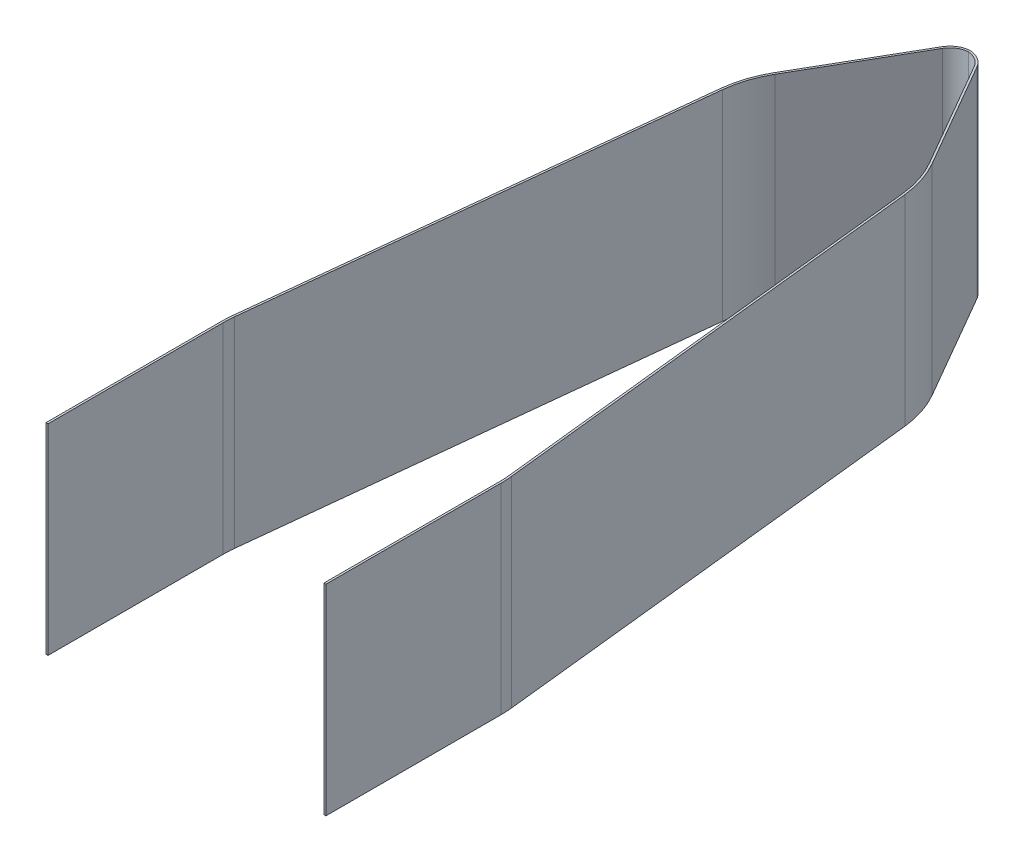
ISO-10303-21;
HEADER;
FILE_DESCRIPTION(('STEP AP214'),'2;1');
FILE_NAME('part.step','',(''),(''),'','','');
FILE_SCHEMA(('AUTOMOTIVE_DESIGN { 1 0 10303 214 1 1 1 1 }'));
ENDSEC;
DATA;
#1=APPLICATION_CONTEXT('core data for automotive mechanical design processes');
#2=APPLICATION_PROTOCOL_DEFINITION('international standard','automotive_design',2000,#1);
#3=PRODUCT_CONTEXT('',#1,'mechanical');
#4=PRODUCT('Part','Part','',(#3));
#5=PRODUCT_RELATED_PRODUCT_CATEGORY('part','',(#4));
#6=PRODUCT_DEFINITION_FORMATION('','',#4);
#7=PRODUCT_DEFINITION_CONTEXT('part definition',#1,'design');
#8=PRODUCT_DEFINITION('design','',#6,#7);
#9=PRODUCT_DEFINITION_SHAPE('','',#8);
#10=(LENGTH_UNIT() NAMED_UNIT(*) SI_UNIT(.MILLI.,.METRE.));
#11=(NAMED_UNIT(*) PLANE_ANGLE_UNIT() SI_UNIT($,.RADIAN.));
#12=(NAMED_UNIT(*) SI_UNIT($,.STERADIAN.) SOLID_ANGLE_UNIT());
#13=UNCERTAINTY_MEASURE_WITH_UNIT(LENGTH_MEASURE(1.E-05),#10,'distance_accuracy_value','');
#14=(GEOMETRIC_REPRESENTATION_CONTEXT(3) GLOBAL_UNCERTAINTY_ASSIGNED_CONTEXT((#13)) GLOBAL_UNIT_ASSIGNED_CONTEXT((#10,
#11,#12)) REPRESENTATION_CONTEXT('',''));
#15=CARTESIAN_POINT('',(0.,0.,0.));
#16=DIRECTION('',(0.,0.,1.));
#17=DIRECTION('',(1.,0.,0.));
#18=AXIS2_PLACEMENT_3D('',#15,#16,#17);
#19=CARTESIAN_POINT('',(4.7625,12.7,-24.7202799887067));
#20=DIRECTION('',(0.,-1.,0.));
#21=DIRECTION('',(0.,0.,-1.));
#22=AXIS2_PLACEMENT_3D('',#19,#20,#21);
#23=CYLINDRICAL_SURFACE('',#22,12.7);
#24=DIRECTION('',(0.,1.,0.));
#25=VECTOR('',#24,1.);
#26=CARTESIAN_POINT('',(17.4625,12.7,-24.7202799887067));
#27=LINE('',#26,#25);
#28=CARTESIAN_POINT('',(17.4625,-12.7,-24.7202799887067));
#29=VERTEX_POINT('',#28);
#30=CARTESIAN_POINT('',(17.4625,12.7,-24.7202799887067));
#31=VERTEX_POINT('',#30);
#32=EDGE_CURVE('E351',#29,#31,#27,.T.);
#33=ORIENTED_EDGE('',*,*,#32,.T.);
#34=CARTESIAN_POINT('',(4.7625,12.7,-24.7202799887067));
#35=DIRECTION('',(0.,-1.,0.));
#36=DIRECTION('',(0.,0.,-1.));
#37=AXIS2_PLACEMENT_3D('',#34,#35,#36);
#38=CIRCLE('',#37,12.7);
#39=CARTESIAN_POINT('',(17.3899488806237,12.7,-26.0758369839065));
#40=VERTEX_POINT('',#39);
#41=EDGE_CURVE('E20',#40,#31,#38,.T.);
#42=ORIENTED_EDGE('',*,*,#41,.F.);
#43=DIRECTION('',(0.,1.,0.));
#44=VECTOR('',#43,1.);
#45=CARTESIAN_POINT('',(17.3899488806237,12.7,-26.0758369839065));
#46=LINE('',#45,#44);
#47=CARTESIAN_POINT('',(17.3899488806237,-12.7,-26.0758369839065));
#48=VERTEX_POINT('',#47);
#49=EDGE_CURVE('E353',#40,#48,#46,.F.);
#50=ORIENTED_EDGE('',*,*,#49,.T.);
#51=CARTESIAN_POINT('',(4.7625,-12.7,-24.7202799887067));
#52=DIRECTION('',(0.,-1.,0.));
#53=DIRECTION('',(0.,0.,-1.));
#54=AXIS2_PLACEMENT_3D('',#51,#52,#53);
#55=CIRCLE('',#54,12.7);
#56=EDGE_CURVE('E395',#29,#48,#55,.F.);
#57=ORIENTED_EDGE('',*,*,#56,.F.);
#58=EDGE_LOOP('',(#33,#42,#50,#57));
#59=FACE_BOUND('',#58,.T.);
#60=ADVANCED_FACE('F17',(#59),#23,.F.);
#61=CARTESIAN_POINT('',(17.4625,12.7,-2.53999999999484));
#62=DIRECTION('',(0.,0.,-1.));
#63=DIRECTION('',(-1.,0.,0.));
#64=AXIS2_PLACEMENT_3D('',#61,#62,#63);
#65=PLANE('',#64);
#66=DIRECTION('',(0.,1.,0.));
#67=VECTOR('',#66,1.);
#68=CARTESIAN_POINT('',(17.7165,12.7,-2.53999999999484));
#69=LINE('',#68,#67);
#70=CARTESIAN_POINT('',(17.7165,-12.7,-2.53999999999484));
#71=VERTEX_POINT('',#70);
#72=CARTESIAN_POINT('',(17.7165,12.7,-2.53999999999484));
#73=VERTEX_POINT('',#72);
#74=EDGE_CURVE('E346',#71,#73,#69,.T.);
#75=ORIENTED_EDGE('',*,*,#74,.T.);
#76=DIRECTION('',(-1.,0.,0.));
#77=VECTOR('',#76,1.);
#78=CARTESIAN_POINT('',(17.4625,12.7,-2.53999999999484));
#79=LINE('',#78,#77);
#80=CARTESIAN_POINT('',(17.4625,12.7,-2.53999999999484));
#81=VERTEX_POINT('',#80);
#82=EDGE_CURVE('E183',#81,#73,#79,.F.);
#83=ORIENTED_EDGE('',*,*,#82,.F.);
#84=DIRECTION('',(0.,1.,0.));
#85=VECTOR('',#84,1.);
#86=CARTESIAN_POINT('',(17.4625,12.7,-2.53999999999484));
#87=LINE('',#86,#85);
#88=CARTESIAN_POINT('',(17.4625,-12.7,-2.53999999999484));
#89=VERTEX_POINT('',#88);
#90=EDGE_CURVE('E348',#81,#89,#87,.F.);
#91=ORIENTED_EDGE('',*,*,#90,.T.);
#92=DIRECTION('',(-1.,0.,0.));
#93=VECTOR('',#92,1.);
#94=CARTESIAN_POINT('',(17.4625,-12.7,-2.53999999999484));
#95=LINE('',#94,#93);
#96=EDGE_CURVE('E389',#71,#89,#95,.T.);
#97=ORIENTED_EDGE('',*,*,#96,.F.);
#98=EDGE_LOOP('',(#75,#83,#91,#97));
#99=FACE_BOUND('',#98,.T.);
#100=ADVANCED_FACE('F515',(#99),#65,.F.);
#101=CARTESIAN_POINT('',(4.7625,12.7,-24.7202799887067));
#102=DIRECTION('',(0.,-1.,0.));
#103=DIRECTION('',(0.,0.,-1.));
#104=AXIS2_PLACEMENT_3D('',#101,#102,#103);
#105=CYLINDRICAL_SURFACE('',#104,12.954);
#106=CARTESIAN_POINT('',(4.7625,12.7,-24.7202799887067));
#107=DIRECTION('',(0.,-1.,0.));
#108=DIRECTION('',(0.,0.,-1.));
#109=AXIS2_PLACEMENT_3D('',#106,#107,#108);
#110=CIRCLE('',#109,12.954);
#111=CARTESIAN_POINT('',(17.6424978582362,12.7,-26.1029481238105));
#112=VERTEX_POINT('',#111);
#113=CARTESIAN_POINT('',(17.7165,12.7,-24.7202799887067));
#114=VERTEX_POINT('',#113);
#115=EDGE_CURVE('E386',#112,#114,#110,.T.);
#116=ORIENTED_EDGE('',*,*,#115,.T.);
#117=DIRECTION('',(0.,1.,0.));
#118=VECTOR('',#117,1.);
#119=CARTESIAN_POINT('',(17.7165,12.7,-24.7202799887067));
#120=LINE('',#119,#118);
#121=CARTESIAN_POINT('',(17.7165,-12.7,-24.7202799887067));
#122=VERTEX_POINT('',#121);
#123=EDGE_CURVE('E343',#114,#122,#120,.F.);
#124=ORIENTED_EDGE('',*,*,#123,.T.);
#125=CARTESIAN_POINT('',(4.7625,-12.7,-24.7202799887067));
#126=DIRECTION('',(0.,-1.,0.));
#127=DIRECTION('',(0.,0.,-1.));
#128=AXIS2_PLACEMENT_3D('',#125,#126,#127);
#129=CIRCLE('',#128,12.954);
#130=CARTESIAN_POINT('',(17.6424978582362,-12.7,-26.1029481238105));
#131=VERTEX_POINT('',#130);
#132=EDGE_CURVE('E391',#122,#131,#129,.F.);
#133=ORIENTED_EDGE('',*,*,#132,.T.);
#134=DIRECTION('',(0.,1.,0.));
#135=VECTOR('',#134,1.);
#136=CARTESIAN_POINT('',(17.6424978582362,12.7,-26.1029481238105));
#137=LINE('',#136,#135);
#138=EDGE_CURVE('E340',#131,#112,#137,.T.);
#139=ORIENTED_EDGE('',*,*,#138,.T.);
#140=EDGE_LOOP('',(#116,#124,#133,#139));
#141=FACE_BOUND('',#140,.T.);
#142=ADVANCED_FACE('F510',(#141),#105,.T.);
#143=CARTESIAN_POINT('',(-17.4625,12.7,-2.53999999999483));
#144=DIRECTION('',(0.,0.,-1.));
#145=DIRECTION('',(-1.,0.,0.));
#146=AXIS2_PLACEMENT_3D('',#143,#144,#145);
#147=PLANE('',#146);
#148=DIRECTION('',(0.,1.,0.));
#149=VECTOR('',#148,1.);
#150=CARTESIAN_POINT('',(-17.4625,12.7,-2.53999999999483));
#151=LINE('',#150,#149);
#152=CARTESIAN_POINT('',(-17.4625,-12.7,-2.53999999999483));
#153=VERTEX_POINT('',#152);
#154=CARTESIAN_POINT('',(-17.4625,12.7,-2.53999999999483));
#155=VERTEX_POINT('',#154);
#156=EDGE_CURVE('E218',#153,#155,#151,.T.);
#157=ORIENTED_EDGE('',*,*,#156,.T.);
#158=DIRECTION('',(-1.,0.,0.));
#159=VECTOR('',#158,1.);
#160=CARTESIAN_POINT('',(-17.4625,12.7,-2.53999999999483));
#161=LINE('',#160,#159);
#162=CARTESIAN_POINT('',(-17.7165,12.7,-2.53999999999483));
#163=VERTEX_POINT('',#162);
#164=EDGE_CURVE('E210',#163,#155,#161,.F.);
#165=ORIENTED_EDGE('',*,*,#164,.F.);
#166=DIRECTION('',(0.,1.,0.));
#167=VECTOR('',#166,1.);
#168=CARTESIAN_POINT('',(-17.7165,12.7,-2.53999999999483));
#169=LINE('',#168,#167);
#170=CARTESIAN_POINT('',(-17.7165,-12.7,-2.53999999999483));
#171=VERTEX_POINT('',#170);
#172=EDGE_CURVE('E213',#163,#171,#169,.F.);
#173=ORIENTED_EDGE('',*,*,#172,.T.);
#174=DIRECTION('',(-1.,0.,0.));
#175=VECTOR('',#174,1.);
#176=CARTESIAN_POINT('',(-17.4625,-12.7,-2.53999999999483));
#177=LINE('',#176,#175);
#178=EDGE_CURVE('E199',#153,#171,#177,.T.);
#179=ORIENTED_EDGE('',*,*,#178,.F.);
#180=EDGE_LOOP('',(#157,#165,#173,#179));
#181=FACE_BOUND('',#180,.T.);
#182=ADVANCED_FACE('F214',(#181),#147,.F.);
#183=CARTESIAN_POINT('',(-4.7625,12.7,-24.7202799887067));
#184=DIRECTION('',(0.,-1.,0.));
#185=DIRECTION('',(0.,0.,-1.));
#186=AXIS2_PLACEMENT_3D('',#183,#184,#185);
#187=CYLINDRICAL_SURFACE('',#186,12.7);
#188=DIRECTION('',(0.,1.,0.));
#189=VECTOR('',#188,1.);
#190=CARTESIAN_POINT('',(-17.3899488806237,12.7,-26.0758369839065));
#191=LINE('',#190,#189);
#192=CARTESIAN_POINT('',(-17.3899488806237,-12.7,-26.0758369839065));
#193=VERTEX_POINT('',#192);
#194=CARTESIAN_POINT('',(-17.3899488806237,12.7,-26.0758369839065));
#195=VERTEX_POINT('',#194);
#196=EDGE_CURVE('E379',#193,#195,#191,.T.);
#197=ORIENTED_EDGE('',*,*,#196,.T.);
#198=CARTESIAN_POINT('',(-4.7625,12.7,-24.7202799887067));
#199=DIRECTION('',(0.,-1.,0.));
#200=DIRECTION('',(0.,0.,-1.));
#201=AXIS2_PLACEMENT_3D('',#198,#199,#200);
#202=CIRCLE('',#201,12.7);
#203=CARTESIAN_POINT('',(-17.4625,12.7,-24.7202799887067));
#204=VERTEX_POINT('',#203);
#205=EDGE_CURVE('E209',#204,#195,#202,.T.);
#206=ORIENTED_EDGE('',*,*,#205,.F.);
#207=DIRECTION('',(0.,1.,0.));
#208=VECTOR('',#207,1.);
#209=CARTESIAN_POINT('',(-17.4625,12.7,-24.7202799887067));
#210=LINE('',#209,#208);
#211=CARTESIAN_POINT('',(-17.4625,-12.7,-24.7202799887067));
#212=VERTEX_POINT('',#211);
#213=EDGE_CURVE('E319',#204,#212,#210,.F.);
#214=ORIENTED_EDGE('',*,*,#213,.T.);
#215=CARTESIAN_POINT('',(-4.7625,-12.7,-24.7202799887067));
#216=DIRECTION('',(0.,-1.,0.));
#217=DIRECTION('',(0.,0.,-1.));
#218=AXIS2_PLACEMENT_3D('',#215,#216,#217);
#219=CIRCLE('',#218,12.7);
#220=EDGE_CURVE('E381',#193,#212,#219,.F.);
#221=ORIENTED_EDGE('',*,*,#220,.F.);
#222=EDGE_LOOP('',(#197,#206,#214,#221));
#223=FACE_BOUND('',#222,.T.);
#224=ADVANCED_FACE('F463',(#223),#187,.F.);
#225=CARTESIAN_POINT('',(-17.3899488806237,12.7,-26.0758369839065));
#226=DIRECTION('',(-0.994287313434937,0.,-0.106736771275578));
#227=DIRECTION('',(-0.106736771275578,0.,0.994287313434937));
#228=AXIS2_PLACEMENT_3D('',#225,#226,#227);
#229=PLANE('',#228);
#230=DIRECTION('',(0.,-1.,0.));
#231=VECTOR('',#230,1.);
#232=CARTESIAN_POINT('',(-11.3990597357465,12.7,-81.8828939312004));
#233=LINE('',#232,#231);
#234=CARTESIAN_POINT('',(-11.3990597357465,-12.7,-81.8828939312004));
#235=VERTEX_POINT('',#234);
#236=CARTESIAN_POINT('',(-11.3990597357465,12.7,-81.8828939312004));
#237=VERTEX_POINT('',#236);
#238=EDGE_CURVE('E376',#235,#237,#233,.F.);
#239=ORIENTED_EDGE('',*,*,#238,.T.);
#240=DIRECTION('',(0.106736771275578,0.,-0.994287313434937));
#241=VECTOR('',#240,1.);
#242=CARTESIAN_POINT('',(-17.3899488806237,12.7,-26.0758369839065));
#243=LINE('',#242,#241);
#244=EDGE_CURVE('E316',#195,#237,#243,.T.);
#245=ORIENTED_EDGE('',*,*,#244,.F.);
#246=ORIENTED_EDGE('',*,*,#196,.F.);
#247=DIRECTION('',(0.106736771275578,0.,-0.994287313434937));
#248=VECTOR('',#247,1.);
#249=CARTESIAN_POINT('',(-17.3899488806237,-12.7,-26.0758369839065));
#250=LINE('',#249,#248);
#251=EDGE_CURVE('E268',#193,#235,#250,.T.);
#252=ORIENTED_EDGE('',*,*,#251,.T.);
#253=EDGE_LOOP('',(#239,#245,#246,#252));
#254=FACE_BOUND('',#253,.T.);
#255=ADVANCED_FACE('F459',(#254),#229,.F.);
#256=CARTESIAN_POINT('',(1.22838914487718,12.7,-80.5273369360006));
#257=DIRECTION('',(0.,-1.,0.));
#258=DIRECTION('',(0.,0.,-1.));
#259=AXIS2_PLACEMENT_3D('',#256,#257,#258);
#260=CYLINDRICAL_SURFACE('',#259,12.7);
#261=DIRECTION('',(0.,1.,0.));
#262=VECTOR('',#261,1.);
#263=CARTESIAN_POINT('',(-9.77013348318521,12.7,-86.8773369360005));
#264=LINE('',#263,#262);
#265=CARTESIAN_POINT('',(-9.77013348318521,-12.7,-86.8773369360005));
#266=VERTEX_POINT('',#265);
#267=CARTESIAN_POINT('',(-9.77013348318521,12.7,-86.8773369360005));
#268=VERTEX_POINT('',#267);
#269=EDGE_CURVE('E373',#266,#268,#264,.T.);
#270=ORIENTED_EDGE('',*,*,#269,.T.);
#271=CARTESIAN_POINT('',(1.22838914487718,12.7,-80.5273369360006));
#272=DIRECTION('',(0.,-1.,0.));
#273=DIRECTION('',(0.,0.,-1.));
#274=AXIS2_PLACEMENT_3D('',#271,#272,#273);
#275=CIRCLE('',#274,12.7);
#276=EDGE_CURVE('E315',#237,#268,#275,.T.);
#277=ORIENTED_EDGE('',*,*,#276,.F.);
#278=ORIENTED_EDGE('',*,*,#238,.F.);
#279=CARTESIAN_POINT('',(1.22838914487718,-12.7,-80.5273369360006));
#280=DIRECTION('',(0.,-1.,0.));
#281=DIRECTION('',(0.,0.,-1.));
#282=AXIS2_PLACEMENT_3D('',#279,#280,#281);
#283=CIRCLE('',#282,12.7);
#284=EDGE_CURVE('E267',#235,#266,#283,.T.);
#285=ORIENTED_EDGE('',*,*,#284,.T.);
#286=EDGE_LOOP('',(#270,#277,#278,#285));
#287=FACE_BOUND('',#286,.T.);
#288=ADVANCED_FACE('F455',(#287),#260,.F.);
#289=CARTESIAN_POINT('',(-9.77013348318521,12.7,-86.8773369360005));
#290=DIRECTION('',(-0.86602540378444,0.,-0.499999999999998));
#291=DIRECTION('',(-0.499999999999998,0.,0.86602540378444));
#292=AXIS2_PLACEMENT_3D('',#289,#290,#291);
#293=PLANE('',#292);
#294=DIRECTION('',(0.,-1.,0.));
#295=VECTOR('',#294,1.);
#296=CARTESIAN_POINT('',(-2.00323484187083,12.7,-100.329999999995));
#297=LINE('',#296,#295);
#298=CARTESIAN_POINT('',(-2.00323484187082,-12.7,-100.329999999995));
#299=VERTEX_POINT('',#298);
#300=CARTESIAN_POINT('',(-2.00323484187082,12.7,-100.329999999995));
#301=VERTEX_POINT('',#300);
#302=EDGE_CURVE('E370',#299,#301,#297,.F.);
#303=ORIENTED_EDGE('',*,*,#302,.T.);
#304=DIRECTION('',(0.499999999999998,0.,-0.86602540378444));
#305=VECTOR('',#304,1.);
#306=CARTESIAN_POINT('',(-9.77013348318521,12.7,-86.8773369360005));
#307=LINE('',#306,#305);
#308=EDGE_CURVE('E312',#268,#301,#307,.T.);
#309=ORIENTED_EDGE('',*,*,#308,.F.);
#310=ORIENTED_EDGE('',*,*,#269,.F.);
#311=DIRECTION('',(0.499999999999998,0.,-0.86602540378444));
#312=VECTOR('',#311,1.);
#313=CARTESIAN_POINT('',(-9.77013348318521,-12.7,-86.8773369360005));
#314=LINE('',#313,#312);
#315=EDGE_CURVE('E263',#266,#299,#314,.T.);
#316=ORIENTED_EDGE('',*,*,#315,.T.);
#317=EDGE_LOOP('',(#303,#309,#310,#316));
#318=FACE_BOUND('',#317,.T.);
#319=ADVANCED_FACE('F451',(#318),#293,.F.);
#320=CARTESIAN_POINT('',(0.196469683741654,12.7,-99.0599999999948));
#321=DIRECTION('',(0.,-1.,0.));
#322=DIRECTION('',(0.,0.,-1.));
#323=AXIS2_PLACEMENT_3D('',#320,#321,#322);
#324=CYLINDRICAL_SURFACE('',#323,2.54);
#325=DIRECTION('',(0.,-1.,0.));
#326=VECTOR('',#325,1.);
#327=CARTESIAN_POINT('',(0.,12.7,-101.592390108839));
#328=LINE('',#327,#326);
#329=CARTESIAN_POINT('',(0.,-12.7,-101.592390108839));
#330=VERTEX_POINT('',#329);
#331=CARTESIAN_POINT('',(0.,12.7,-101.592390108839));
#332=VERTEX_POINT('',#331);
#333=EDGE_CURVE('E367',#330,#332,#328,.F.);
#334=ORIENTED_EDGE('',*,*,#333,.T.);
#335=CARTESIAN_POINT('',(0.196469683741654,12.7,-99.0599999999948));
#336=DIRECTION('',(0.,-1.,0.));
#337=DIRECTION('',(0.,0.,-1.));
#338=AXIS2_PLACEMENT_3D('',#335,#336,#337);
#339=CIRCLE('',#338,2.54);
#340=EDGE_CURVE('E314',#301,#332,#339,.T.);
#341=ORIENTED_EDGE('',*,*,#340,.F.);
#342=ORIENTED_EDGE('',*,*,#302,.F.);
#343=CARTESIAN_POINT('',(0.196469683741654,-12.7,-99.0599999999948));
#344=DIRECTION('',(0.,-1.,0.));
#345=DIRECTION('',(0.,0.,-1.));
#346=AXIS2_PLACEMENT_3D('',#343,#344,#345);
#347=CIRCLE('',#346,2.54);
#348=EDGE_CURVE('E266',#299,#330,#347,.T.);
#349=ORIENTED_EDGE('',*,*,#348,.T.);
#350=EDGE_LOOP('',(#334,#341,#342,#349));
#351=FACE_BOUND('',#350,.T.);
#352=ADVANCED_FACE('F447',(#351),#324,.F.);
#353=CARTESIAN_POINT('',(-0.196469683741655,12.7,-99.0599999999948));
#354=DIRECTION('',(0.,-1.,0.));
#355=DIRECTION('',(0.,0.,-1.));
#356=AXIS2_PLACEMENT_3D('',#353,#354,#355);
#357=CYLINDRICAL_SURFACE('',#356,2.54);
#358=DIRECTION('',(0.,1.,0.));
#359=VECTOR('',#358,1.);
#360=CARTESIAN_POINT('',(2.00323484187082,12.7,-100.329999999995));
#361=LINE('',#360,#359);
#362=CARTESIAN_POINT('',(2.00323484187082,-12.7,-100.329999999995));
#363=VERTEX_POINT('',#362);
#364=CARTESIAN_POINT('',(2.00323484187082,12.7,-100.329999999995));
#365=VERTEX_POINT('',#364);
#366=EDGE_CURVE('E364',#363,#365,#361,.T.);
#367=ORIENTED_EDGE('',*,*,#366,.T.);
#368=CARTESIAN_POINT('',(-0.196469683741655,12.7,-99.0599999999948));
#369=DIRECTION('',(0.,-1.,0.));
#370=DIRECTION('',(0.,0.,-1.));
#371=AXIS2_PLACEMENT_3D('',#368,#369,#370);
#372=CIRCLE('',#371,2.54);
#373=EDGE_CURVE('E311',#332,#365,#372,.T.);
#374=ORIENTED_EDGE('',*,*,#373,.F.);
#375=ORIENTED_EDGE('',*,*,#333,.F.);
#376=CARTESIAN_POINT('',(-0.196469683741655,-12.7,-99.0599999999948));
#377=DIRECTION('',(0.,-1.,0.));
#378=DIRECTION('',(0.,0.,-1.));
#379=AXIS2_PLACEMENT_3D('',#376,#377,#378);
#380=CIRCLE('',#379,2.54);
#381=EDGE_CURVE('E262',#330,#363,#380,.T.);
#382=ORIENTED_EDGE('',*,*,#381,.T.);
#383=EDGE_LOOP('',(#367,#374,#375,#382));
#384=FACE_BOUND('',#383,.T.);
#385=ADVANCED_FACE('F443',(#384),#357,.F.);
#386=CARTESIAN_POINT('',(2.00323484187082,12.7,-100.329999999995));
#387=DIRECTION('',(0.86602540378444,0.,-0.499999999999998));
#388=DIRECTION('',(-0.499999999999998,0.,-0.86602540378444));
#389=AXIS2_PLACEMENT_3D('',#386,#387,#388);
#390=PLANE('',#389);
#391=DIRECTION('',(0.,-1.,0.));
#392=VECTOR('',#391,1.);
#393=CARTESIAN_POINT('',(9.77013348318521,12.7,-86.8773369360005));
#394=LINE('',#393,#392);
#395=CARTESIAN_POINT('',(9.77013348318521,-12.7,-86.8773369360005));
#396=VERTEX_POINT('',#395);
#397=CARTESIAN_POINT('',(9.77013348318521,12.7,-86.8773369360005));
#398=VERTEX_POINT('',#397);
#399=EDGE_CURVE('E360',#396,#398,#394,.F.);
#400=ORIENTED_EDGE('',*,*,#399,.T.);
#401=DIRECTION('',(0.499999999999998,0.,0.86602540378444));
#402=VECTOR('',#401,1.);
#403=CARTESIAN_POINT('',(2.00323484187082,12.7,-100.329999999995));
#404=LINE('',#403,#402);
#405=EDGE_CURVE('E309',#365,#398,#404,.T.);
#406=ORIENTED_EDGE('',*,*,#405,.F.);
#407=ORIENTED_EDGE('',*,*,#366,.F.);
#408=DIRECTION('',(0.499999999999998,0.,0.86602540378444));
#409=VECTOR('',#408,1.);
#410=CARTESIAN_POINT('',(2.00323484187082,-12.7,-100.329999999995));
#411=LINE('',#410,#409);
#412=EDGE_CURVE('E259',#363,#396,#411,.T.);
#413=ORIENTED_EDGE('',*,*,#412,.T.);
#414=EDGE_LOOP('',(#400,#406,#407,#413));
#415=FACE_BOUND('',#414,.T.);
#416=ADVANCED_FACE('F439',(#415),#390,.F.);
#417=CARTESIAN_POINT('',(-1.22838914487718,12.7,-80.5273369360006));
#418=DIRECTION('',(0.,-1.,0.));
#419=DIRECTION('',(0.,0.,-1.));
#420=AXIS2_PLACEMENT_3D('',#417,#418,#419);
#421=CYLINDRICAL_SURFACE('',#420,12.7);
#422=DIRECTION('',(0.,1.,0.));
#423=VECTOR('',#422,1.);
#424=CARTESIAN_POINT('',(11.3990597357465,12.7,-81.8828939312004));
#425=LINE('',#424,#423);
#426=CARTESIAN_POINT('',(11.3990597357465,-12.7,-81.8828939312004));
#427=VERTEX_POINT('',#426);
#428=CARTESIAN_POINT('',(11.3990597357465,12.7,-81.8828939312004));
#429=VERTEX_POINT('',#428);
#430=EDGE_CURVE('E357',#427,#429,#425,.T.);
#431=ORIENTED_EDGE('',*,*,#430,.T.);
#432=CARTESIAN_POINT('',(-1.22838914487718,12.7,-80.5273369360006));
#433=DIRECTION('',(0.,-1.,0.));
#434=DIRECTION('',(0.,0.,-1.));
#435=AXIS2_PLACEMENT_3D('',#432,#433,#434);
#436=CIRCLE('',#435,12.7);
#437=EDGE_CURVE('E308',#398,#429,#436,.T.);
#438=ORIENTED_EDGE('',*,*,#437,.F.);
#439=ORIENTED_EDGE('',*,*,#399,.F.);
#440=CARTESIAN_POINT('',(-1.22838914487718,-12.7,-80.5273369360006));
#441=DIRECTION('',(0.,-1.,0.));
#442=DIRECTION('',(0.,0.,-1.));
#443=AXIS2_PLACEMENT_3D('',#440,#441,#442);
#444=CIRCLE('',#443,12.7);
#445=EDGE_CURVE('E258',#396,#427,#444,.T.);
#446=ORIENTED_EDGE('',*,*,#445,.T.);
#447=EDGE_LOOP('',(#431,#438,#439,#446));
#448=FACE_BOUND('',#447,.T.);
#449=ADVANCED_FACE('F435',(#448),#421,.F.);
#450=CARTESIAN_POINT('',(11.3990597357465,12.7,-81.8828939312004));
#451=DIRECTION('',(0.994287313434937,0.,-0.106736771275578));
#452=DIRECTION('',(-0.106736771275578,0.,-0.994287313434937));
#453=AXIS2_PLACEMENT_3D('',#450,#451,#452);
#454=PLANE('',#453);
#455=ORIENTED_EDGE('',*,*,#49,.F.);
#456=DIRECTION('',(0.106736771275578,0.,0.994287313434937));
#457=VECTOR('',#456,1.);
#458=CARTESIAN_POINT('',(11.3990597357465,12.7,-81.8828939312004));
#459=LINE('',#458,#457);
#460=EDGE_CURVE('E304',#429,#40,#459,.T.);
#461=ORIENTED_EDGE('',*,*,#460,.F.);
#462=ORIENTED_EDGE('',*,*,#430,.F.);
#463=DIRECTION('',(0.106736771275578,0.,0.994287313434937));
#464=VECTOR('',#463,1.);
#465=CARTESIAN_POINT('',(11.3990597357465,-12.7,-81.8828939312004));
#466=LINE('',#465,#464);
#467=EDGE_CURVE('E253',#427,#48,#466,.T.);
#468=ORIENTED_EDGE('',*,*,#467,.T.);
#469=EDGE_LOOP('',(#455,#461,#462,#468));
#470=FACE_BOUND('',#469,.T.);
#471=ADVANCED_FACE('F432',(#470),#454,.F.);
#472=CARTESIAN_POINT('',(17.4625,12.7,-24.7202799887067));
#473=DIRECTION('',(1.,0.,0.));
#474=DIRECTION('',(0.,0.,-1.));
#475=AXIS2_PLACEMENT_3D('',#472,#473,#474);
#476=PLANE('',#475);
#477=ORIENTED_EDGE('',*,*,#90,.F.);
#478=DIRECTION('',(0.,0.,1.));
#479=VECTOR('',#478,1.);
#480=CARTESIAN_POINT('',(17.4625,12.7,-24.7202799887067));
#481=LINE('',#480,#479);
#482=EDGE_CURVE('E300',#31,#81,#481,.T.);
#483=ORIENTED_EDGE('',*,*,#482,.F.);
#484=ORIENTED_EDGE('',*,*,#32,.F.);
#485=DIRECTION('',(0.,0.,1.));
#486=VECTOR('',#485,1.);
#487=CARTESIAN_POINT('',(17.4625,-12.7,-24.7202799887067));
#488=LINE('',#487,#486);
#489=EDGE_CURVE('E248',#29,#89,#488,.T.);
#490=ORIENTED_EDGE('',*,*,#489,.T.);
#491=EDGE_LOOP('',(#477,#483,#484,#490));
#492=FACE_BOUND('',#491,.T.);
#493=ADVANCED_FACE('F518',(#492),#476,.F.);
#494=CARTESIAN_POINT('',(17.7165,12.7,-24.7202799887067));
#495=DIRECTION('',(-1.,0.,0.));
#496=DIRECTION('',(0.,0.,1.));
#497=AXIS2_PLACEMENT_3D('',#494,#495,#496);
#498=PLANE('',#497);
#499=ORIENTED_EDGE('',*,*,#123,.F.);
#500=DIRECTION('',(0.,0.,1.));
#501=VECTOR('',#500,1.);
#502=CARTESIAN_POINT('',(17.7165,12.7,-24.7202799887067));
#503=LINE('',#502,#501);
#504=EDGE_CURVE('E298',#73,#114,#503,.F.);
#505=ORIENTED_EDGE('',*,*,#504,.F.);
#506=ORIENTED_EDGE('',*,*,#74,.F.);
#507=DIRECTION('',(0.,0.,1.));
#508=VECTOR('',#507,1.);
#509=CARTESIAN_POINT('',(17.7165,-12.7,-24.7202799887067));
#510=LINE('',#509,#508);
#511=EDGE_CURVE('E245',#71,#122,#510,.F.);
#512=ORIENTED_EDGE('',*,*,#511,.T.);
#513=EDGE_LOOP('',(#499,#505,#506,#512));
#514=FACE_BOUND('',#513,.T.);
#515=ADVANCED_FACE('F514',(#514),#498,.F.);
#516=CARTESIAN_POINT('',(11.651608713359,12.7,-81.9100050711044));
#517=DIRECTION('',(-0.994287313434937,0.,0.106736771275578));
#518=DIRECTION('',(0.106736771275578,0.,0.994287313434937));
#519=AXIS2_PLACEMENT_3D('',#516,#517,#518);
#520=PLANE('',#519);
#521=DIRECTION('',(0.,-1.,0.));
#522=VECTOR('',#521,1.);
#523=CARTESIAN_POINT('',(11.651608713359,12.7,-81.9100050711044));
#524=LINE('',#523,#522);
#525=CARTESIAN_POINT('',(11.651608713359,12.7,-81.9100050711044));
#526=VERTEX_POINT('',#525);
#527=CARTESIAN_POINT('',(11.651608713359,-12.7,-81.9100050711044));
#528=VERTEX_POINT('',#527);
#529=EDGE_CURVE('E338',#526,#528,#524,.T.);
#530=ORIENTED_EDGE('',*,*,#529,.F.);
#531=DIRECTION('',(-0.106736771275578,0.,-0.994287313434937));
#532=VECTOR('',#531,1.);
#533=CARTESIAN_POINT('',(17.6424978582362,12.7,-26.1029481238105));
#534=LINE('',#533,#532);
#535=EDGE_CURVE('E296',#112,#526,#534,.T.);
#536=ORIENTED_EDGE('',*,*,#535,.F.);
#537=ORIENTED_EDGE('',*,*,#138,.F.);
#538=DIRECTION('',(-0.106736771275578,0.,-0.994287313434937));
#539=VECTOR('',#538,1.);
#540=CARTESIAN_POINT('',(17.6424978582362,-12.7,-26.1029481238105));
#541=LINE('',#540,#539);
#542=EDGE_CURVE('E242',#131,#528,#541,.T.);
#543=ORIENTED_EDGE('',*,*,#542,.T.);
#544=EDGE_LOOP('',(#530,#536,#537,#543));
#545=FACE_BOUND('',#544,.T.);
#546=ADVANCED_FACE('F505',(#545),#520,.F.);
#547=CARTESIAN_POINT('',(-1.22838914487718,12.7,-80.5273369360006));
#548=DIRECTION('',(0.,-1.,0.));
#549=DIRECTION('',(0.,0.,-1.));
#550=AXIS2_PLACEMENT_3D('',#547,#548,#549);
#551=CYLINDRICAL_SURFACE('',#550,12.954);
#552=CARTESIAN_POINT('',(-1.22838914487718,12.7,-80.5273369360006));
#553=DIRECTION('',(0.,-1.,0.));
#554=DIRECTION('',(0.,0.,-1.));
#555=AXIS2_PLACEMENT_3D('',#552,#553,#554);
#556=CIRCLE('',#555,12.954);
#557=CARTESIAN_POINT('',(9.99010393574646,12.7,-87.0043369360005));
#558=VERTEX_POINT('',#557);
#559=EDGE_CURVE('E295',#526,#558,#556,.F.);
#560=ORIENTED_EDGE('',*,*,#559,.F.);
#561=ORIENTED_EDGE('',*,*,#529,.T.);
#562=CARTESIAN_POINT('',(-1.22838914487718,-12.7,-80.5273369360006));
#563=DIRECTION('',(0.,-1.,0.));
#564=DIRECTION('',(0.,0.,-1.));
#565=AXIS2_PLACEMENT_3D('',#562,#563,#564);
#566=CIRCLE('',#565,12.954);
#567=CARTESIAN_POINT('',(9.99010393574646,-12.7,-87.0043369360005));
#568=VERTEX_POINT('',#567);
#569=EDGE_CURVE('E241',#528,#568,#566,.F.);
#570=ORIENTED_EDGE('',*,*,#569,.T.);
#571=DIRECTION('',(0.,1.,0.));
#572=VECTOR('',#571,1.);
#573=CARTESIAN_POINT('',(9.99010393574646,12.7,-87.0043369360005));
#574=LINE('',#573,#572);
#575=EDGE_CURVE('E335',#568,#558,#574,.T.);
#576=ORIENTED_EDGE('',*,*,#575,.T.);
#577=EDGE_LOOP('',(#560,#561,#570,#576));
#578=FACE_BOUND('',#577,.T.);
#579=ADVANCED_FACE('F501',(#578),#551,.T.);
#580=CARTESIAN_POINT('',(2.22320529443207,12.7,-100.456999999995));
#581=DIRECTION('',(-0.86602540378444,0.,0.499999999999998));
#582=DIRECTION('',(0.499999999999998,0.,0.86602540378444));
#583=AXIS2_PLACEMENT_3D('',#580,#581,#582);
#584=PLANE('',#583);
#585=DIRECTION('',(0.,-1.,0.));
#586=VECTOR('',#585,1.);
#587=CARTESIAN_POINT('',(2.22320529443206,12.7,-100.456999999995));
#588=LINE('',#587,#586);
#589=CARTESIAN_POINT('',(2.22320529443207,12.7,-100.456999999995));
#590=VERTEX_POINT('',#589);
#591=CARTESIAN_POINT('',(2.22320529443207,-12.7,-100.456999999995));
#592=VERTEX_POINT('',#591);
#593=EDGE_CURVE('E333',#590,#592,#588,.T.);
#594=ORIENTED_EDGE('',*,*,#593,.F.);
#595=DIRECTION('',(-0.499999999999997,0.,-0.86602540378444));
#596=VECTOR('',#595,1.);
#597=CARTESIAN_POINT('',(9.99010393574646,12.7,-87.0043369360005));
#598=LINE('',#597,#596);
#599=EDGE_CURVE('E292',#558,#590,#598,.T.);
#600=ORIENTED_EDGE('',*,*,#599,.F.);
#601=ORIENTED_EDGE('',*,*,#575,.F.);
#602=DIRECTION('',(-0.499999999999997,0.,-0.86602540378444));
#603=VECTOR('',#602,1.);
#604=CARTESIAN_POINT('',(9.99010393574646,-12.7,-87.0043369360005));
#605=LINE('',#604,#603);
#606=EDGE_CURVE('E237',#568,#592,#605,.T.);
#607=ORIENTED_EDGE('',*,*,#606,.T.);
#608=EDGE_LOOP('',(#594,#600,#601,#607));
#609=FACE_BOUND('',#608,.T.);
#610=ADVANCED_FACE('F496',(#609),#584,.F.);
#611=CARTESIAN_POINT('',(-0.196469683741655,12.7,-99.0599999999948));
#612=DIRECTION('',(0.,-1.,0.));
#613=DIRECTION('',(0.,0.,-1.));
#614=AXIS2_PLACEMENT_3D('',#611,#612,#613);
#615=CYLINDRICAL_SURFACE('',#614,2.79399999999999);
#616=CARTESIAN_POINT('',(-0.196469683741655,12.7,-99.0599999999948));
#617=DIRECTION('',(0.,-1.,0.));
#618=DIRECTION('',(0.,0.,-1.));
#619=AXIS2_PLACEMENT_3D('',#616,#617,#618);
#620=CIRCLE('',#619,2.79399999999999);
#621=CARTESIAN_POINT('',(0.,12.7,-101.847083720189));
#622=VERTEX_POINT('',#621);
#623=EDGE_CURVE('E294',#590,#622,#620,.F.);
#624=ORIENTED_EDGE('',*,*,#623,.F.);
#625=ORIENTED_EDGE('',*,*,#593,.T.);
#626=CARTESIAN_POINT('',(-0.196469683741655,-12.7,-99.0599999999948));
#627=DIRECTION('',(0.,-1.,0.));
#628=DIRECTION('',(0.,0.,-1.));
#629=AXIS2_PLACEMENT_3D('',#626,#627,#628);
#630=CIRCLE('',#629,2.79399999999999);
#631=CARTESIAN_POINT('',(0.,-12.7,-101.847083720189));
#632=VERTEX_POINT('',#631);
#633=EDGE_CURVE('E240',#592,#632,#630,.F.);
#634=ORIENTED_EDGE('',*,*,#633,.T.);
#635=DIRECTION('',(0.,-1.,0.));
#636=VECTOR('',#635,1.);
#637=CARTESIAN_POINT('',(0.,12.7,-101.847083720189));
#638=LINE('',#637,#636);
#639=EDGE_CURVE('E331',#622,#632,#638,.T.);
#640=ORIENTED_EDGE('',*,*,#639,.F.);
#641=EDGE_LOOP('',(#624,#625,#634,#640));
#642=FACE_BOUND('',#641,.T.);
#643=ADVANCED_FACE('F492',(#642),#615,.T.);
#644=CARTESIAN_POINT('',(0.196469683741654,12.7,-99.0599999999948));
#645=DIRECTION('',(0.,-1.,0.));
#646=DIRECTION('',(0.,0.,-1.));
#647=AXIS2_PLACEMENT_3D('',#644,#645,#646);
#648=CYLINDRICAL_SURFACE('',#647,2.79399999999999);
#649=CARTESIAN_POINT('',(0.196469683741654,12.7,-99.0599999999948));
#650=DIRECTION('',(0.,-1.,0.));
#651=DIRECTION('',(0.,0.,-1.));
#652=AXIS2_PLACEMENT_3D('',#649,#650,#651);
#653=CIRCLE('',#652,2.79399999999999);
#654=CARTESIAN_POINT('',(-2.22320529443207,12.7,-100.456999999995));
#655=VERTEX_POINT('',#654);
#656=EDGE_CURVE('E291',#622,#655,#653,.F.);
#657=ORIENTED_EDGE('',*,*,#656,.F.);
#658=ORIENTED_EDGE('',*,*,#639,.T.);
#659=CARTESIAN_POINT('',(0.196469683741654,-12.7,-99.0599999999948));
#660=DIRECTION('',(0.,-1.,0.));
#661=DIRECTION('',(0.,0.,-1.));
#662=AXIS2_PLACEMENT_3D('',#659,#660,#661);
#663=CIRCLE('',#662,2.79399999999999);
#664=CARTESIAN_POINT('',(-2.22320529443207,-12.7,-100.456999999995));
#665=VERTEX_POINT('',#664);
#666=EDGE_CURVE('E236',#632,#665,#663,.F.);
#667=ORIENTED_EDGE('',*,*,#666,.T.);
#668=DIRECTION('',(0.,1.,0.));
#669=VECTOR('',#668,1.);
#670=CARTESIAN_POINT('',(-2.22320529443207,12.7,-100.456999999995));
#671=LINE('',#670,#669);
#672=EDGE_CURVE('E219',#665,#655,#671,.T.);
#673=ORIENTED_EDGE('',*,*,#672,.T.);
#674=EDGE_LOOP('',(#657,#658,#667,#673));
#675=FACE_BOUND('',#674,.T.);
#676=ADVANCED_FACE('F486',(#675),#648,.T.);
#677=CARTESIAN_POINT('',(-9.99010393574646,12.7,-87.0043369360005));
#678=DIRECTION('',(0.86602540378444,0.,0.499999999999998));
#679=DIRECTION('',(0.499999999999998,0.,-0.86602540378444));
#680=AXIS2_PLACEMENT_3D('',#677,#678,#679);
#681=PLANE('',#680);
#682=DIRECTION('',(0.,-1.,0.));
#683=VECTOR('',#682,1.);
#684=CARTESIAN_POINT('',(-9.99010393574645,12.7,-87.0043369360005));
#685=LINE('',#684,#683);
#686=CARTESIAN_POINT('',(-9.99010393574646,12.7,-87.0043369360005));
#687=VERTEX_POINT('',#686);
#688=CARTESIAN_POINT('',(-9.99010393574646,-12.7,-87.0043369360005));
#689=VERTEX_POINT('',#688);
#690=EDGE_CURVE('E318',#687,#689,#685,.T.);
#691=ORIENTED_EDGE('',*,*,#690,.F.);
#692=DIRECTION('',(-0.499999999999998,0.,0.86602540378444));
#693=VECTOR('',#692,1.);
#694=CARTESIAN_POINT('',(-2.22320529443207,12.7,-100.456999999995));
#695=LINE('',#694,#693);
#696=EDGE_CURVE('E289',#655,#687,#695,.T.);
#697=ORIENTED_EDGE('',*,*,#696,.F.);
#698=ORIENTED_EDGE('',*,*,#672,.F.);
#699=DIRECTION('',(-0.499999999999998,0.,0.86602540378444));
#700=VECTOR('',#699,1.);
#701=CARTESIAN_POINT('',(-2.22320529443207,-12.7,-100.456999999995));
#702=LINE('',#701,#700);
#703=EDGE_CURVE('E233',#665,#689,#702,.T.);
#704=ORIENTED_EDGE('',*,*,#703,.T.);
#705=EDGE_LOOP('',(#691,#697,#698,#704));
#706=FACE_BOUND('',#705,.T.);
#707=ADVANCED_FACE('F481',(#706),#681,.F.);
#708=CARTESIAN_POINT('',(-17.7165,12.7,-2.53999999999483));
#709=DIRECTION('',(1.,0.,0.));
#710=DIRECTION('',(0.,0.,-1.));
#711=AXIS2_PLACEMENT_3D('',#708,#709,#710);
#712=PLANE('',#711);
#713=ORIENTED_EDGE('',*,*,#172,.F.);
#714=DIRECTION('',(0.,0.,1.));
#715=VECTOR('',#714,1.);
#716=CARTESIAN_POINT('',(-17.7165,12.7,-24.7202799887067));
#717=LINE('',#716,#715);
#718=CARTESIAN_POINT('',(-17.7165,12.7,-24.7202799887067));
#719=VERTEX_POINT('',#718);
#720=EDGE_CURVE('E282',#719,#163,#717,.T.);
#721=ORIENTED_EDGE('',*,*,#720,.F.);
#722=DIRECTION('',(0.,-1.,0.));
#723=VECTOR('',#722,1.);
#724=CARTESIAN_POINT('',(-17.7165,12.7,-24.7202799887066));
#725=LINE('',#724,#723);
#726=CARTESIAN_POINT('',(-17.7165,-12.7,-24.7202799887067));
#727=VERTEX_POINT('',#726);
#728=EDGE_CURVE('E222',#727,#719,#725,.F.);
#729=ORIENTED_EDGE('',*,*,#728,.F.);
#730=DIRECTION('',(0.,0.,1.));
#731=VECTOR('',#730,1.);
#732=CARTESIAN_POINT('',(-17.7165,-12.7,-24.7202799887067));
#733=LINE('',#732,#731);
#734=EDGE_CURVE('E203',#727,#171,#733,.T.);
#735=ORIENTED_EDGE('',*,*,#734,.T.);
#736=EDGE_LOOP('',(#713,#721,#729,#735));
#737=FACE_BOUND('',#736,.T.);
#738=ADVANCED_FACE('F221',(#737),#712,.F.);
#739=CARTESIAN_POINT('',(-17.4625,12.7,-2.53999999999483));
#740=DIRECTION('',(-1.,0.,0.));
#741=DIRECTION('',(0.,0.,1.));
#742=AXIS2_PLACEMENT_3D('',#739,#740,#741);
#743=PLANE('',#742);
#744=ORIENTED_EDGE('',*,*,#213,.F.);
#745=DIRECTION('',(0.,0.,1.));
#746=VECTOR('',#745,1.);
#747=CARTESIAN_POINT('',(-17.4625,12.7,-24.7202799887067));
#748=LINE('',#747,#746);
#749=EDGE_CURVE('E279',#155,#204,#748,.F.);
#750=ORIENTED_EDGE('',*,*,#749,.F.);
#751=ORIENTED_EDGE('',*,*,#156,.F.);
#752=DIRECTION('',(0.,0.,1.));
#753=VECTOR('',#752,1.);
#754=CARTESIAN_POINT('',(-17.4625,-12.7,-24.7202799887067));
#755=LINE('',#754,#753);
#756=EDGE_CURVE('E205',#153,#212,#755,.F.);
#757=ORIENTED_EDGE('',*,*,#756,.T.);
#758=EDGE_LOOP('',(#744,#750,#751,#757));
#759=FACE_BOUND('',#758,.T.);
#760=ADVANCED_FACE('F466',(#759),#743,.F.);
#761=CARTESIAN_POINT('',(1.22838914487718,12.7,-80.5273369360006));
#762=DIRECTION('',(0.,-1.,0.));
#763=DIRECTION('',(0.,0.,-1.));
#764=AXIS2_PLACEMENT_3D('',#761,#762,#763);
#765=CYLINDRICAL_SURFACE('',#764,12.954);
#766=CARTESIAN_POINT('',(1.22838914487718,12.7,-80.5273369360006));
#767=DIRECTION('',(0.,-1.,0.));
#768=DIRECTION('',(0.,0.,-1.));
#769=AXIS2_PLACEMENT_3D('',#766,#767,#768);
#770=CIRCLE('',#769,12.954);
#771=CARTESIAN_POINT('',(-11.651608713359,12.7,-81.9100050711044));
#772=VERTEX_POINT('',#771);
#773=EDGE_CURVE('E286',#687,#772,#770,.F.);
#774=ORIENTED_EDGE('',*,*,#773,.F.);
#775=ORIENTED_EDGE('',*,*,#690,.T.);
#776=CARTESIAN_POINT('',(1.22838914487718,-12.7,-80.5273369360006));
#777=DIRECTION('',(0.,-1.,0.));
#778=DIRECTION('',(0.,0.,-1.));
#779=AXIS2_PLACEMENT_3D('',#776,#777,#778);
#780=CIRCLE('',#779,12.954);
#781=CARTESIAN_POINT('',(-11.651608713359,-12.7,-81.9100050711044));
#782=VERTEX_POINT('',#781);
#783=EDGE_CURVE('E226',#689,#782,#780,.F.);
#784=ORIENTED_EDGE('',*,*,#783,.T.);
#785=DIRECTION('',(0.,1.,0.));
#786=VECTOR('',#785,1.);
#787=CARTESIAN_POINT('',(-11.651608713359,12.7,-81.9100050711044));
#788=LINE('',#787,#786);
#789=EDGE_CURVE('E224',#782,#772,#788,.T.);
#790=ORIENTED_EDGE('',*,*,#789,.T.);
#791=EDGE_LOOP('',(#774,#775,#784,#790));
#792=FACE_BOUND('',#791,.T.);
#793=ADVANCED_FACE('F539',(#792),#765,.T.);
#794=CARTESIAN_POINT('',(-4.7625,12.7,-24.7202799887067));
#795=DIRECTION('',(0.,1.,0.));
#796=DIRECTION('',(0.,0.,1.));
#797=AXIS2_PLACEMENT_3D('',#794,#795,#796);
#798=PLANE('',#797);
#799=ORIENTED_EDGE('',*,*,#164,.T.);
#800=ORIENTED_EDGE('',*,*,#749,.T.);
#801=ORIENTED_EDGE('',*,*,#205,.T.);
#802=ORIENTED_EDGE('',*,*,#244,.T.);
#803=ORIENTED_EDGE('',*,*,#276,.T.);
#804=ORIENTED_EDGE('',*,*,#308,.T.);
#805=ORIENTED_EDGE('',*,*,#340,.T.);
#806=ORIENTED_EDGE('',*,*,#373,.T.);
#807=ORIENTED_EDGE('',*,*,#405,.T.);
#808=ORIENTED_EDGE('',*,*,#437,.T.);
#809=ORIENTED_EDGE('',*,*,#460,.T.);
#810=ORIENTED_EDGE('',*,*,#41,.T.);
#811=ORIENTED_EDGE('',*,*,#482,.T.);
#812=ORIENTED_EDGE('',*,*,#82,.T.);
#813=ORIENTED_EDGE('',*,*,#504,.T.);
#814=ORIENTED_EDGE('',*,*,#115,.F.);
#815=ORIENTED_EDGE('',*,*,#535,.T.);
#816=ORIENTED_EDGE('',*,*,#559,.T.);
#817=ORIENTED_EDGE('',*,*,#599,.T.);
#818=ORIENTED_EDGE('',*,*,#623,.T.);
#819=ORIENTED_EDGE('',*,*,#656,.T.);
#820=ORIENTED_EDGE('',*,*,#696,.T.);
#821=ORIENTED_EDGE('',*,*,#773,.T.);
#822=DIRECTION('',(0.106736771275578,0.,-0.994287313434937));
#823=VECTOR('',#822,1.);
#824=CARTESIAN_POINT('',(-17.6424978582362,12.7,-26.1029481238105));
#825=LINE('',#824,#823);
#826=CARTESIAN_POINT('',(-17.6424978582362,12.7,-26.1029481238105));
#827=VERTEX_POINT('',#826);
#828=EDGE_CURVE('E273',#772,#827,#825,.F.);
#829=ORIENTED_EDGE('',*,*,#828,.T.);
#830=CARTESIAN_POINT('',(-4.7625,12.7,-24.7202799887067));
#831=DIRECTION('',(0.,-1.,0.));
#832=DIRECTION('',(0.,0.,-1.));
#833=AXIS2_PLACEMENT_3D('',#830,#831,#832);
#834=CIRCLE('',#833,12.954);
#835=EDGE_CURVE('E271',#719,#827,#834,.T.);
#836=ORIENTED_EDGE('',*,*,#835,.F.);
#837=ORIENTED_EDGE('',*,*,#720,.T.);
#838=EDGE_LOOP('',(#799,#800,#801,#802,#803,#804,#805,#806,#807,#808,#809,#810,#811,#812,#813,
#814,#815,#816,#817,#818,#819,#820,#821,#829,#836,#837));
#839=FACE_BOUND('',#838,.T.);
#840=ADVANCED_FACE('F467',(#839),#798,.T.);
#841=CARTESIAN_POINT('',(-4.7625,12.7,-24.7202799887067));
#842=DIRECTION('',(0.,-1.,0.));
#843=DIRECTION('',(0.,0.,-1.));
#844=AXIS2_PLACEMENT_3D('',#841,#842,#843);
#845=CYLINDRICAL_SURFACE('',#844,12.954);
#846=ORIENTED_EDGE('',*,*,#835,.T.);
#847=DIRECTION('',(0.,1.,0.));
#848=VECTOR('',#847,1.);
#849=CARTESIAN_POINT('',(-17.6424978582362,12.7,-26.1029481238105));
#850=LINE('',#849,#848);
#851=CARTESIAN_POINT('',(-17.6424978582362,-12.7,-26.1029481238105));
#852=VERTEX_POINT('',#851);
#853=EDGE_CURVE('E26',#827,#852,#850,.F.);
#854=ORIENTED_EDGE('',*,*,#853,.T.);
#855=CARTESIAN_POINT('',(-4.7625,-12.7,-24.7202799887067));
#856=DIRECTION('',(0.,-1.,0.));
#857=DIRECTION('',(0.,0.,-1.));
#858=AXIS2_PLACEMENT_3D('',#855,#856,#857);
#859=CIRCLE('',#858,12.954);
#860=EDGE_CURVE('E34',#852,#727,#859,.F.);
#861=ORIENTED_EDGE('',*,*,#860,.T.);
#862=ORIENTED_EDGE('',*,*,#728,.T.);
#863=EDGE_LOOP('',(#846,#854,#861,#862));
#864=FACE_BOUND('',#863,.T.);
#865=ADVANCED_FACE('F472',(#864),#845,.T.);
#866=CARTESIAN_POINT('',(-4.7625,-12.7,-24.7202799887067));
#867=DIRECTION('',(0.,1.,0.));
#868=DIRECTION('',(0.,0.,1.));
#869=AXIS2_PLACEMENT_3D('',#866,#867,#868);
#870=PLANE('',#869);
#871=ORIENTED_EDGE('',*,*,#756,.F.);
#872=ORIENTED_EDGE('',*,*,#178,.T.);
#873=ORIENTED_EDGE('',*,*,#734,.F.);
#874=ORIENTED_EDGE('',*,*,#860,.F.);
#875=DIRECTION('',(0.106736771275578,0.,-0.994287313434937));
#876=VECTOR('',#875,1.);
#877=CARTESIAN_POINT('',(-17.6424978582362,-12.7,-26.1029481238105));
#878=LINE('',#877,#876);
#879=EDGE_CURVE('E11',#852,#782,#878,.T.);
#880=ORIENTED_EDGE('',*,*,#879,.T.);
#881=ORIENTED_EDGE('',*,*,#783,.F.);
#882=ORIENTED_EDGE('',*,*,#703,.F.);
#883=ORIENTED_EDGE('',*,*,#666,.F.);
#884=ORIENTED_EDGE('',*,*,#633,.F.);
#885=ORIENTED_EDGE('',*,*,#606,.F.);
#886=ORIENTED_EDGE('',*,*,#569,.F.);
#887=ORIENTED_EDGE('',*,*,#542,.F.);
#888=ORIENTED_EDGE('',*,*,#132,.F.);
#889=ORIENTED_EDGE('',*,*,#511,.F.);
#890=ORIENTED_EDGE('',*,*,#96,.T.);
#891=ORIENTED_EDGE('',*,*,#489,.F.);
#892=ORIENTED_EDGE('',*,*,#56,.T.);
#893=ORIENTED_EDGE('',*,*,#467,.F.);
#894=ORIENTED_EDGE('',*,*,#445,.F.);
#895=ORIENTED_EDGE('',*,*,#412,.F.);
#896=ORIENTED_EDGE('',*,*,#381,.F.);
#897=ORIENTED_EDGE('',*,*,#348,.F.);
#898=ORIENTED_EDGE('',*,*,#315,.F.);
#899=ORIENTED_EDGE('',*,*,#284,.F.);
#900=ORIENTED_EDGE('',*,*,#251,.F.);
#901=ORIENTED_EDGE('',*,*,#220,.T.);
#902=EDGE_LOOP('',(#871,#872,#873,#874,#880,#881,#882,#883,#884,#885,#886,#887,#888,#889,#890,
#891,#892,#893,#894,#895,#896,#897,#898,#899,#900,#901));
#903=FACE_BOUND('',#902,.T.);
#904=ADVANCED_FACE('F201',(#903),#870,.F.);
#905=CARTESIAN_POINT('',(-17.6424978582362,12.7,-26.1029481238105));
#906=DIRECTION('',(0.994287313434937,0.,0.106736771275578));
#907=DIRECTION('',(0.106736771275578,0.,-0.994287313434937));
#908=AXIS2_PLACEMENT_3D('',#905,#906,#907);
#909=PLANE('',#908);
#910=ORIENTED_EDGE('',*,*,#853,.F.);
#911=ORIENTED_EDGE('',*,*,#828,.F.);
#912=ORIENTED_EDGE('',*,*,#789,.F.);
#913=ORIENTED_EDGE('',*,*,#879,.F.);
#914=EDGE_LOOP('',(#910,#911,#912,#913));
#915=FACE_BOUND('',#914,.T.);
#916=ADVANCED_FACE('F474',(#915),#909,.F.);
#917=CLOSED_SHELL('',(#60,#100,#142,#182,#224,#255,#288,#319,#352,#385,#416,#449,#471,#493,#515,
#546,#579,#610,#643,#676,#707,#738,#760,#793,#840,#865,#904,#916));
#918=MANIFOLD_SOLID_BREP('B1',#917);
#919=ADVANCED_BREP_SHAPE_REPRESENTATION('',(#18,#918),#14);
#920=SHAPE_DEFINITION_REPRESENTATION(#9,#919);
ENDSEC;
END-ISO-10303-21;
